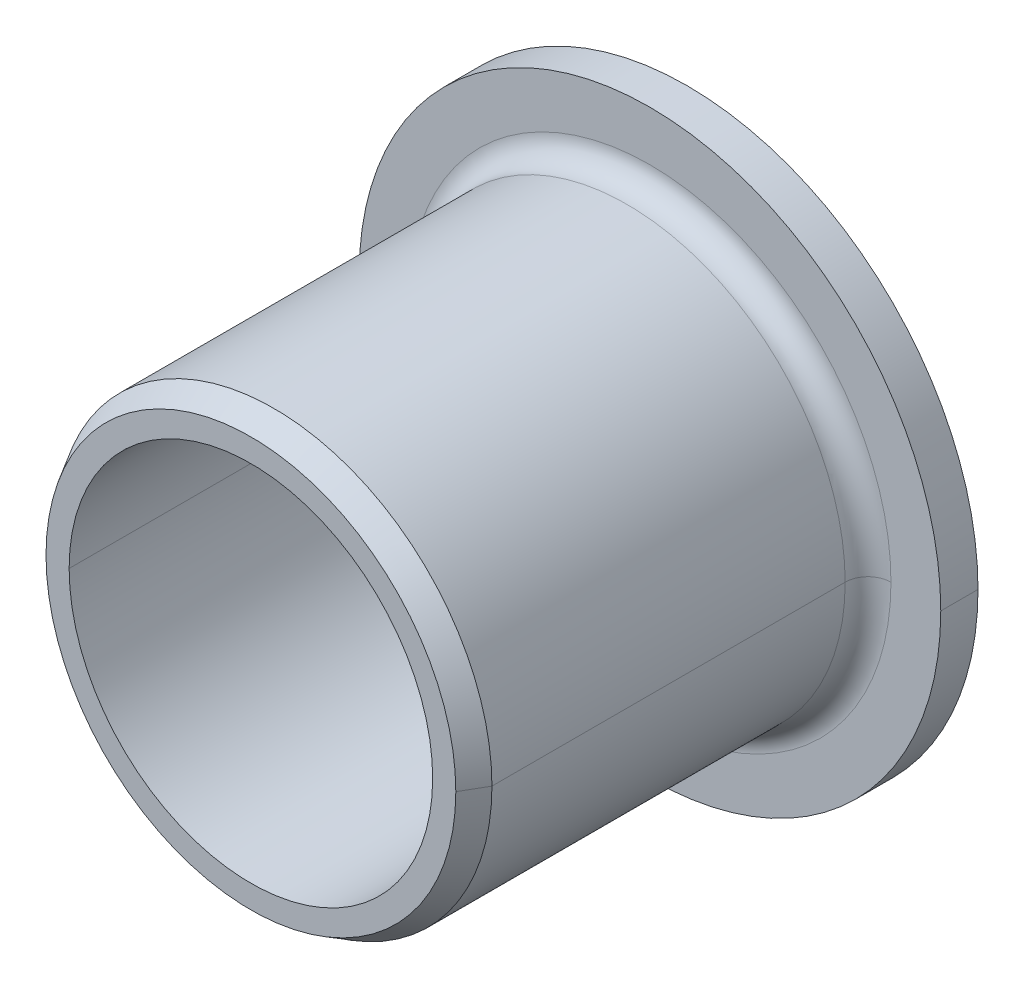
ISO-10303-21;
HEADER;
FILE_DESCRIPTION(('STEP AP214'),'2;1');
FILE_NAME('part.step','',(''),(''),'','','');
FILE_SCHEMA(('AUTOMOTIVE_DESIGN { 1 0 10303 214 1 1 1 1 }'));
ENDSEC;
DATA;
#1=APPLICATION_CONTEXT('core data for automotive mechanical design processes');
#2=APPLICATION_PROTOCOL_DEFINITION('international standard','automotive_design',2000,#1);
#3=PRODUCT_CONTEXT('',#1,'mechanical');
#4=PRODUCT('Part','Part','',(#3));
#5=PRODUCT_RELATED_PRODUCT_CATEGORY('part','',(#4));
#6=PRODUCT_DEFINITION_FORMATION('','',#4);
#7=PRODUCT_DEFINITION_CONTEXT('part definition',#1,'design');
#8=PRODUCT_DEFINITION('design','',#6,#7);
#9=PRODUCT_DEFINITION_SHAPE('','',#8);
#10=(LENGTH_UNIT() NAMED_UNIT(*) SI_UNIT(.MILLI.,.METRE.));
#11=(NAMED_UNIT(*) PLANE_ANGLE_UNIT() SI_UNIT($,.RADIAN.));
#12=(NAMED_UNIT(*) SI_UNIT($,.STERADIAN.) SOLID_ANGLE_UNIT());
#13=UNCERTAINTY_MEASURE_WITH_UNIT(LENGTH_MEASURE(1.E-05),#10,'distance_accuracy_value','');
#14=(GEOMETRIC_REPRESENTATION_CONTEXT(3) GLOBAL_UNCERTAINTY_ASSIGNED_CONTEXT((#13)) GLOBAL_UNIT_ASSIGNED_CONTEXT((#10,
#11,#12)) REPRESENTATION_CONTEXT('',''));
#15=CARTESIAN_POINT('',(0.,0.,0.));
#16=DIRECTION('',(0.,0.,1.));
#17=DIRECTION('',(1.,0.,0.));
#18=AXIS2_PLACEMENT_3D('',#15,#16,#17);
#19=CARTESIAN_POINT('',(5.159375,0.,0.));
#20=DIRECTION('',(0.,0.,-1.));
#21=DIRECTION('',(0.,-1.,0.));
#22=AXIS2_PLACEMENT_3D('',#19,#20,#21);
#23=PLANE('',#22);
#24=CARTESIAN_POINT('',(0.,0.,0.));
#25=DIRECTION('',(0.,0.,1.));
#26=DIRECTION('',(1.,0.,0.));
#27=AXIS2_PLACEMENT_3D('',#24,#25,#26);
#28=CIRCLE('',#27,3.96875);
#29=CARTESIAN_POINT('',(3.96875,0.,0.));
#30=VERTEX_POINT('',#29);
#31=CARTESIAN_POINT('',(-3.96875,0.,0.));
#32=VERTEX_POINT('',#31);
#33=EDGE_CURVE('E10',#30,#32,#28,.T.);
#34=ORIENTED_EDGE('',*,*,#33,.T.);
#35=CARTESIAN_POINT('',(0.,0.,0.));
#36=DIRECTION('',(0.,0.,1.));
#37=DIRECTION('',(1.,0.,0.));
#38=AXIS2_PLACEMENT_3D('',#35,#36,#37);
#39=CIRCLE('',#38,3.96875);
#40=EDGE_CURVE('E20',#32,#30,#39,.T.);
#41=ORIENTED_EDGE('',*,*,#40,.T.);
#42=EDGE_LOOP('',(#34,#41));
#43=FACE_BOUND('',#42,.T.);
#44=CARTESIAN_POINT('',(0.,0.,0.));
#45=DIRECTION('',(0.,0.,1.));
#46=DIRECTION('',(1.,0.,0.));
#47=AXIS2_PLACEMENT_3D('',#44,#45,#46);
#48=CIRCLE('',#47,6.35);
#49=CARTESIAN_POINT('',(6.35,0.,0.));
#50=VERTEX_POINT('',#49);
#51=CARTESIAN_POINT('',(-6.35,0.,0.));
#52=VERTEX_POINT('',#51);
#53=EDGE_CURVE('E128',#50,#52,#48,.T.);
#54=ORIENTED_EDGE('',*,*,#53,.F.);
#55=CARTESIAN_POINT('',(0.,0.,0.));
#56=DIRECTION('',(0.,0.,1.));
#57=DIRECTION('',(1.,0.,0.));
#58=AXIS2_PLACEMENT_3D('',#55,#56,#57);
#59=CIRCLE('',#58,6.35);
#60=EDGE_CURVE('E118',#52,#50,#59,.T.);
#61=ORIENTED_EDGE('',*,*,#60,.F.);
#62=EDGE_LOOP('',(#54,#61));
#63=FACE_BOUND('',#62,.T.);
#64=ADVANCED_FACE('F16',(#43,#63),#23,.T.);
#65=CARTESIAN_POINT('',(0.,0.,4.7625));
#66=DIRECTION('',(0.,0.,1.));
#67=DIRECTION('',(1.,0.,0.));
#68=AXIS2_PLACEMENT_3D('',#65,#66,#67);
#69=CYLINDRICAL_SURFACE('',#68,3.96875);
#70=DIRECTION('',(0.,0.,1.));
#71=VECTOR('',#70,1.);
#72=CARTESIAN_POINT('',(3.96875,0.,4.7625));
#73=LINE('',#72,#71);
#74=CARTESIAN_POINT('',(3.96875,0.,9.525));
#75=VERTEX_POINT('',#74);
#76=EDGE_CURVE('E153',#30,#75,#73,.T.);
#77=ORIENTED_EDGE('',*,*,#76,.T.);
#78=CARTESIAN_POINT('',(0.,0.,9.525));
#79=DIRECTION('',(0.,0.,1.));
#80=DIRECTION('',(1.,0.,0.));
#81=AXIS2_PLACEMENT_3D('',#78,#79,#80);
#82=CIRCLE('',#81,3.96875);
#83=CARTESIAN_POINT('',(-3.96875,0.,9.525));
#84=VERTEX_POINT('',#83);
#85=EDGE_CURVE('E27',#75,#84,#82,.T.);
#86=ORIENTED_EDGE('',*,*,#85,.T.);
#87=DIRECTION('',(0.,0.,-1.));
#88=VECTOR('',#87,1.);
#89=CARTESIAN_POINT('',(-3.96875,0.,4.7625));
#90=LINE('',#89,#88);
#91=EDGE_CURVE('E146',#84,#32,#90,.T.);
#92=ORIENTED_EDGE('',*,*,#91,.T.);
#93=ORIENTED_EDGE('',*,*,#33,.F.);
#94=EDGE_LOOP('',(#77,#86,#92,#93));
#95=FACE_BOUND('',#94,.T.);
#96=ADVANCED_FACE('F232',(#95),#69,.F.);
#97=CARTESIAN_POINT('',(4.2212874327,0.,9.525));
#98=DIRECTION('',(0.,0.,1.));
#99=DIRECTION('',(1.,0.,0.));
#100=AXIS2_PLACEMENT_3D('',#97,#98,#99);
#101=PLANE('',#100);
#102=ORIENTED_EDGE('',*,*,#85,.F.);
#103=CARTESIAN_POINT('',(0.,0.,9.525));
#104=DIRECTION('',(0.,0.,1.));
#105=DIRECTION('',(1.,0.,0.));
#106=AXIS2_PLACEMENT_3D('',#103,#104,#105);
#107=CIRCLE('',#106,3.96875);
#108=EDGE_CURVE('E150',#84,#75,#107,.T.);
#109=ORIENTED_EDGE('',*,*,#108,.F.);
#110=EDGE_LOOP('',(#102,#109));
#111=FACE_BOUND('',#110,.T.);
#112=CARTESIAN_POINT('',(0.,0.,9.525));
#113=DIRECTION('',(0.,0.,1.));
#114=DIRECTION('',(1.,0.,0.));
#115=AXIS2_PLACEMENT_3D('',#112,#113,#114);
#116=CIRCLE('',#115,4.4738248654);
#117=CARTESIAN_POINT('',(4.4738248654,0.,9.525));
#118=VERTEX_POINT('',#117);
#119=CARTESIAN_POINT('',(-4.4738248654,0.,9.525));
#120=VERTEX_POINT('',#119);
#121=EDGE_CURVE('E179',#118,#120,#116,.T.);
#122=ORIENTED_EDGE('',*,*,#121,.T.);
#123=CARTESIAN_POINT('',(0.,0.,9.525));
#124=DIRECTION('',(0.,0.,1.));
#125=DIRECTION('',(1.,0.,0.));
#126=AXIS2_PLACEMENT_3D('',#123,#124,#125);
#127=CIRCLE('',#126,4.4738248654);
#128=EDGE_CURVE('E91',#120,#118,#127,.T.);
#129=ORIENTED_EDGE('',*,*,#128,.T.);
#130=EDGE_LOOP('',(#122,#129));
#131=FACE_BOUND('',#130,.T.);
#132=ADVANCED_FACE('F223',(#111,#131),#101,.T.);
#133=CARTESIAN_POINT('',(0.,0.,9.275));
#134=DIRECTION('',(0.,0.,-1.));
#135=DIRECTION('',(1.,0.,0.));
#136=AXIS2_PLACEMENT_3D('',#133,#134,#135);
#137=CONICAL_SURFACE('',#136,4.6181624327,0.52359877560608);
#138=DIRECTION('',(-0.500000000006738,0.,0.866025403780548));
#139=VECTOR('',#138,1.);
#140=CARTESIAN_POINT('',(4.6181624327,0.,9.275));
#141=LINE('',#140,#139);
#142=CARTESIAN_POINT('',(4.7625,0.,9.025));
#143=VERTEX_POINT('',#142);
#144=EDGE_CURVE('E173',#143,#118,#141,.T.);
#145=ORIENTED_EDGE('',*,*,#144,.T.);
#146=ORIENTED_EDGE('',*,*,#128,.F.);
#147=DIRECTION('',(-0.500000000006738,0.,-0.866025403780548));
#148=VECTOR('',#147,1.);
#149=CARTESIAN_POINT('',(-4.6181624327,0.,9.275));
#150=LINE('',#149,#148);
#151=CARTESIAN_POINT('',(-4.7625,0.,9.025));
#152=VERTEX_POINT('',#151);
#153=EDGE_CURVE('E177',#120,#152,#150,.T.);
#154=ORIENTED_EDGE('',*,*,#153,.T.);
#155=CARTESIAN_POINT('',(0.,0.,9.025));
#156=DIRECTION('',(0.,0.,1.));
#157=DIRECTION('',(1.,0.,0.));
#158=AXIS2_PLACEMENT_3D('',#155,#156,#157);
#159=CIRCLE('',#158,4.7625);
#160=EDGE_CURVE('E99',#152,#143,#159,.T.);
#161=ORIENTED_EDGE('',*,*,#160,.T.);
#162=EDGE_LOOP('',(#145,#146,#154,#161));
#163=FACE_BOUND('',#162,.T.);
#164=ADVANCED_FACE('F221',(#163),#137,.T.);
#165=CARTESIAN_POINT('',(0.,0.,5.1689));
#166=DIRECTION('',(0.,0.,1.));
#167=DIRECTION('',(1.,0.,0.));
#168=AXIS2_PLACEMENT_3D('',#165,#166,#167);
#169=CYLINDRICAL_SURFACE('',#168,4.7625);
#170=DIRECTION('',(0.,0.,1.));
#171=VECTOR('',#170,1.);
#172=CARTESIAN_POINT('',(4.7625,0.,5.1689));
#173=LINE('',#172,#171);
#174=CARTESIAN_POINT('',(4.7625,0.,1.3128));
#175=VERTEX_POINT('',#174);
#176=EDGE_CURVE('E164',#175,#143,#173,.T.);
#177=ORIENTED_EDGE('',*,*,#176,.T.);
#178=ORIENTED_EDGE('',*,*,#160,.F.);
#179=DIRECTION('',(0.,0.,-1.));
#180=VECTOR('',#179,1.);
#181=CARTESIAN_POINT('',(-4.7625,0.,5.1689));
#182=LINE('',#181,#180);
#183=CARTESIAN_POINT('',(-4.7625,0.,1.3128));
#184=VERTEX_POINT('',#183);
#185=EDGE_CURVE('E163',#152,#184,#182,.T.);
#186=ORIENTED_EDGE('',*,*,#185,.T.);
#187=CARTESIAN_POINT('',(0.,0.,1.3128));
#188=DIRECTION('',(0.,0.,1.));
#189=DIRECTION('',(1.,0.,0.));
#190=AXIS2_PLACEMENT_3D('',#187,#188,#189);
#191=CIRCLE('',#190,4.7625);
#192=EDGE_CURVE('E136',#184,#175,#191,.T.);
#193=ORIENTED_EDGE('',*,*,#192,.T.);
#194=EDGE_LOOP('',(#177,#178,#186,#193));
#195=FACE_BOUND('',#194,.T.);
#196=ADVANCED_FACE('F208',(#195),#169,.T.);
#197=CARTESIAN_POINT('',(0.,0.,1.3128));
#198=DIRECTION('',(0.,0.,1.));
#199=DIRECTION('',(1.,0.,0.));
#200=AXIS2_PLACEMENT_3D('',#197,#198,#199);
#201=TOROIDAL_SURFACE('',#200,5.2625,0.5);
#202=CARTESIAN_POINT('',(-5.2625,0.,1.3128));
#203=DIRECTION('',(0.,-1.,0.));
#204=DIRECTION('',(-1.,0.,0.));
#205=AXIS2_PLACEMENT_3D('',#202,#203,#204);
#206=CIRCLE('',#205,0.5);
#207=CARTESIAN_POINT('',(-5.2625,0.,0.8128));
#208=VERTEX_POINT('',#207);
#209=EDGE_CURVE('E186',#208,#184,#206,.T.);
#210=ORIENTED_EDGE('',*,*,#209,.T.);
#211=CARTESIAN_POINT('',(0.,0.,1.3128));
#212=DIRECTION('',(0.,0.,1.));
#213=DIRECTION('',(1.,0.,0.));
#214=AXIS2_PLACEMENT_3D('',#211,#212,#213);
#215=CIRCLE('',#214,4.7625);
#216=EDGE_CURVE('E159',#175,#184,#215,.T.);
#217=ORIENTED_EDGE('',*,*,#216,.F.);
#218=CARTESIAN_POINT('',(5.2625,0.,1.3128));
#219=DIRECTION('',(0.,-1.,0.));
#220=DIRECTION('',(1.,0.,0.));
#221=AXIS2_PLACEMENT_3D('',#218,#219,#220);
#222=CIRCLE('',#221,0.5);
#223=CARTESIAN_POINT('',(5.2625,0.,0.8128));
#224=VERTEX_POINT('',#223);
#225=EDGE_CURVE('E141',#175,#224,#222,.T.);
#226=ORIENTED_EDGE('',*,*,#225,.T.);
#227=CARTESIAN_POINT('',(0.,0.,0.8128));
#228=DIRECTION('',(0.,0.,1.));
#229=DIRECTION('',(1.,0.,0.));
#230=AXIS2_PLACEMENT_3D('',#227,#228,#229);
#231=CIRCLE('',#230,5.2625);
#232=EDGE_CURVE('E113',#224,#208,#231,.T.);
#233=ORIENTED_EDGE('',*,*,#232,.T.);
#234=EDGE_LOOP('',(#210,#217,#226,#233));
#235=FACE_BOUND('',#234,.T.);
#236=ADVANCED_FACE('F230',(#235),#201,.F.);
#237=CARTESIAN_POINT('',(5.80625,0.,0.8128));
#238=DIRECTION('',(0.,0.,1.));
#239=DIRECTION('',(1.,0.,0.));
#240=AXIS2_PLACEMENT_3D('',#237,#238,#239);
#241=PLANE('',#240);
#242=ORIENTED_EDGE('',*,*,#232,.F.);
#243=CARTESIAN_POINT('',(0.,0.,0.8128));
#244=DIRECTION('',(0.,0.,1.));
#245=DIRECTION('',(1.,0.,0.));
#246=AXIS2_PLACEMENT_3D('',#243,#244,#245);
#247=CIRCLE('',#246,5.2625);
#248=EDGE_CURVE('E169',#208,#224,#247,.T.);
#249=ORIENTED_EDGE('',*,*,#248,.F.);
#250=EDGE_LOOP('',(#242,#249));
#251=FACE_BOUND('',#250,.T.);
#252=CARTESIAN_POINT('',(0.,0.,0.8128));
#253=DIRECTION('',(0.,0.,1.));
#254=DIRECTION('',(1.,0.,0.));
#255=AXIS2_PLACEMENT_3D('',#252,#253,#254);
#256=CIRCLE('',#255,6.35);
#257=CARTESIAN_POINT('',(6.35,0.,0.8128));
#258=VERTEX_POINT('',#257);
#259=CARTESIAN_POINT('',(-6.35,0.,0.8128));
#260=VERTEX_POINT('',#259);
#261=EDGE_CURVE('E134',#258,#260,#256,.T.);
#262=ORIENTED_EDGE('',*,*,#261,.T.);
#263=CARTESIAN_POINT('',(0.,0.,0.8128));
#264=DIRECTION('',(0.,0.,1.));
#265=DIRECTION('',(1.,0.,0.));
#266=AXIS2_PLACEMENT_3D('',#263,#264,#265);
#267=CIRCLE('',#266,6.35);
#268=EDGE_CURVE('E41',#260,#258,#267,.T.);
#269=ORIENTED_EDGE('',*,*,#268,.T.);
#270=EDGE_LOOP('',(#262,#269));
#271=FACE_BOUND('',#270,.T.);
#272=ADVANCED_FACE('F245',(#251,#271),#241,.T.);
#273=CARTESIAN_POINT('',(0.,0.,0.4064));
#274=DIRECTION('',(0.,0.,1.));
#275=DIRECTION('',(1.,0.,0.));
#276=AXIS2_PLACEMENT_3D('',#273,#274,#275);
#277=CYLINDRICAL_SURFACE('',#276,6.35);
#278=DIRECTION('',(0.,0.,1.));
#279=VECTOR('',#278,1.);
#280=CARTESIAN_POINT('',(6.35,0.,0.4064));
#281=LINE('',#280,#279);
#282=EDGE_CURVE('E121',#50,#258,#281,.T.);
#283=ORIENTED_EDGE('',*,*,#282,.T.);
#284=ORIENTED_EDGE('',*,*,#268,.F.);
#285=DIRECTION('',(0.,0.,-1.));
#286=VECTOR('',#285,1.);
#287=CARTESIAN_POINT('',(-6.35,0.,0.4064));
#288=LINE('',#287,#286);
#289=EDGE_CURVE('E123',#260,#52,#288,.T.);
#290=ORIENTED_EDGE('',*,*,#289,.T.);
#291=ORIENTED_EDGE('',*,*,#60,.T.);
#292=EDGE_LOOP('',(#283,#284,#290,#291));
#293=FACE_BOUND('',#292,.T.);
#294=ADVANCED_FACE('F18',(#293),#277,.T.);
#295=CARTESIAN_POINT('',(0.,0.,0.4064));
#296=DIRECTION('',(0.,0.,1.));
#297=DIRECTION('',(1.,0.,0.));
#298=AXIS2_PLACEMENT_3D('',#295,#296,#297);
#299=CYLINDRICAL_SURFACE('',#298,6.35);
#300=ORIENTED_EDGE('',*,*,#282,.F.);
#301=ORIENTED_EDGE('',*,*,#53,.T.);
#302=ORIENTED_EDGE('',*,*,#289,.F.);
#303=ORIENTED_EDGE('',*,*,#261,.F.);
#304=EDGE_LOOP('',(#300,#301,#302,#303));
#305=FACE_BOUND('',#304,.T.);
#306=ADVANCED_FACE('F133',(#305),#299,.T.);
#307=CARTESIAN_POINT('',(0.,0.,1.3128));
#308=DIRECTION('',(0.,0.,1.));
#309=DIRECTION('',(1.,0.,0.));
#310=AXIS2_PLACEMENT_3D('',#307,#308,#309);
#311=TOROIDAL_SURFACE('',#310,5.2625,0.5);
#312=ORIENTED_EDGE('',*,*,#209,.F.);
#313=ORIENTED_EDGE('',*,*,#248,.T.);
#314=ORIENTED_EDGE('',*,*,#225,.F.);
#315=ORIENTED_EDGE('',*,*,#192,.F.);
#316=EDGE_LOOP('',(#312,#313,#314,#315));
#317=FACE_BOUND('',#316,.T.);
#318=ADVANCED_FACE('F248',(#317),#311,.F.);
#319=CARTESIAN_POINT('',(0.,0.,5.1689));
#320=DIRECTION('',(0.,0.,1.));
#321=DIRECTION('',(1.,0.,0.));
#322=AXIS2_PLACEMENT_3D('',#319,#320,#321);
#323=CYLINDRICAL_SURFACE('',#322,4.7625);
#324=ORIENTED_EDGE('',*,*,#176,.F.);
#325=ORIENTED_EDGE('',*,*,#216,.T.);
#326=ORIENTED_EDGE('',*,*,#185,.F.);
#327=CARTESIAN_POINT('',(0.,0.,9.025));
#328=DIRECTION('',(0.,0.,1.));
#329=DIRECTION('',(1.,0.,0.));
#330=AXIS2_PLACEMENT_3D('',#327,#328,#329);
#331=CIRCLE('',#330,4.7625);
#332=EDGE_CURVE('E174',#143,#152,#331,.T.);
#333=ORIENTED_EDGE('',*,*,#332,.F.);
#334=EDGE_LOOP('',(#324,#325,#326,#333));
#335=FACE_BOUND('',#334,.T.);
#336=ADVANCED_FACE('F212',(#335),#323,.T.);
#337=CARTESIAN_POINT('',(0.,0.,9.275));
#338=DIRECTION('',(0.,0.,-1.));
#339=DIRECTION('',(1.,0.,0.));
#340=AXIS2_PLACEMENT_3D('',#337,#338,#339);
#341=CONICAL_SURFACE('',#340,4.6181624327,0.52359877560608);
#342=ORIENTED_EDGE('',*,*,#144,.F.);
#343=ORIENTED_EDGE('',*,*,#332,.T.);
#344=ORIENTED_EDGE('',*,*,#153,.F.);
#345=ORIENTED_EDGE('',*,*,#121,.F.);
#346=EDGE_LOOP('',(#342,#343,#344,#345));
#347=FACE_BOUND('',#346,.T.);
#348=ADVANCED_FACE('F215',(#347),#341,.T.);
#349=CARTESIAN_POINT('',(0.,0.,4.7625));
#350=DIRECTION('',(0.,0.,1.));
#351=DIRECTION('',(1.,0.,0.));
#352=AXIS2_PLACEMENT_3D('',#349,#350,#351);
#353=CYLINDRICAL_SURFACE('',#352,3.96875);
#354=ORIENTED_EDGE('',*,*,#76,.F.);
#355=ORIENTED_EDGE('',*,*,#40,.F.);
#356=ORIENTED_EDGE('',*,*,#91,.F.);
#357=ORIENTED_EDGE('',*,*,#108,.T.);
#358=EDGE_LOOP('',(#354,#355,#356,#357));
#359=FACE_BOUND('',#358,.T.);
#360=ADVANCED_FACE('F254',(#359),#353,.F.);
#361=CLOSED_SHELL('',(#64,#96,#132,#164,#196,#236,#272,#294,#306,#318,#336,#348,#360));
#362=MANIFOLD_SOLID_BREP('B1',#361);
#363=ADVANCED_BREP_SHAPE_REPRESENTATION('',(#18,#362),#14);
#364=SHAPE_DEFINITION_REPRESENTATION(#9,#363);
ENDSEC;
END-ISO-10303-21;
